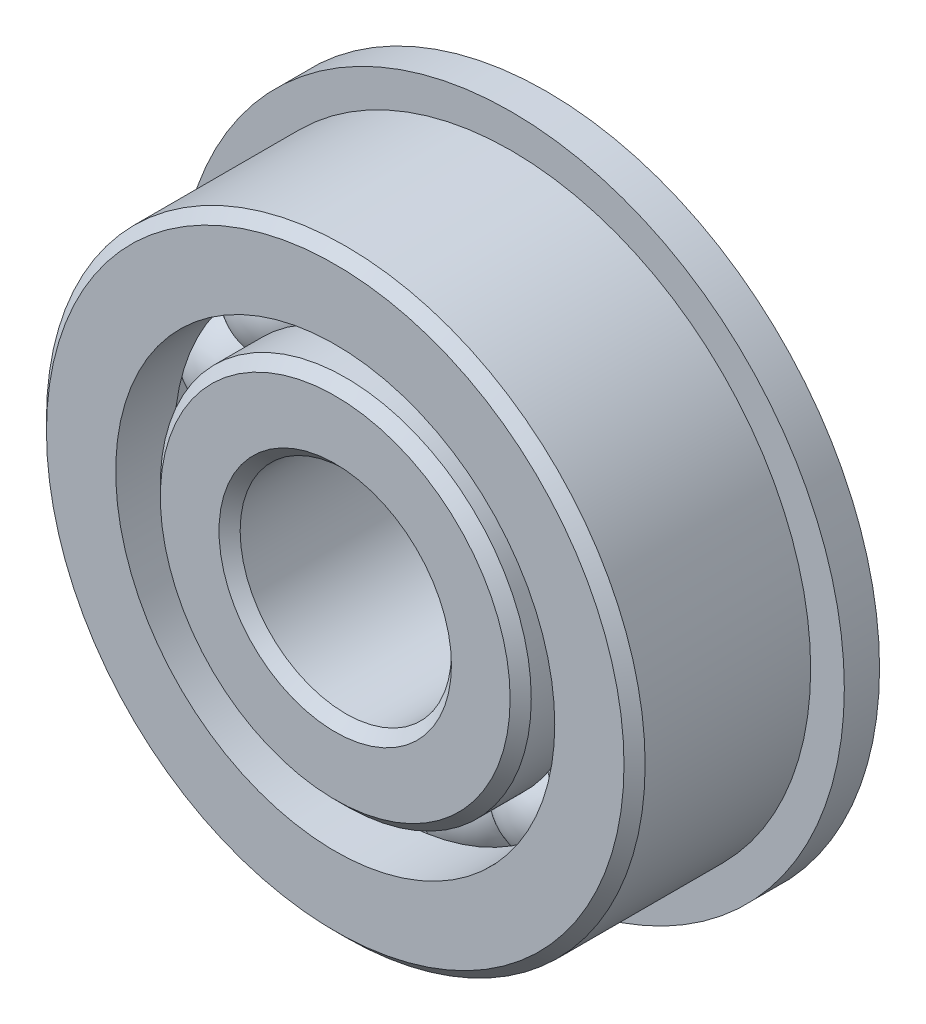
ISO-10303-21;
HEADER;
FILE_DESCRIPTION(('STEP AP214'),'2;1');
FILE_NAME('part.step','',(''),(''),'','','');
FILE_SCHEMA(('AUTOMOTIVE_DESIGN { 1 0 10303 214 1 1 1 1 }'));
ENDSEC;
DATA;
#1=APPLICATION_CONTEXT('core data for automotive mechanical design processes');
#2=APPLICATION_PROTOCOL_DEFINITION('international standard','automotive_design',2000,#1);
#3=PRODUCT_CONTEXT('',#1,'mechanical');
#4=PRODUCT('Part','Part','',(#3));
#5=PRODUCT_RELATED_PRODUCT_CATEGORY('part','',(#4));
#6=PRODUCT_DEFINITION_FORMATION('','',#4);
#7=PRODUCT_DEFINITION_CONTEXT('part definition',#1,'design');
#8=PRODUCT_DEFINITION('design','',#6,#7);
#9=PRODUCT_DEFINITION_SHAPE('','',#8);
#10=(LENGTH_UNIT() NAMED_UNIT(*) SI_UNIT(.MILLI.,.METRE.));
#11=(NAMED_UNIT(*) PLANE_ANGLE_UNIT() SI_UNIT($,.RADIAN.));
#12=(NAMED_UNIT(*) SI_UNIT($,.STERADIAN.) SOLID_ANGLE_UNIT());
#13=UNCERTAINTY_MEASURE_WITH_UNIT(LENGTH_MEASURE(1.E-05),#10,'distance_accuracy_value','');
#14=(GEOMETRIC_REPRESENTATION_CONTEXT(3) GLOBAL_UNCERTAINTY_ASSIGNED_CONTEXT((#13)) GLOBAL_UNIT_ASSIGNED_CONTEXT((#10,
#11,#12)) REPRESENTATION_CONTEXT('',''));
#15=CARTESIAN_POINT('',(0.,0.,0.));
#16=DIRECTION('',(0.,0.,1.));
#17=DIRECTION('',(1.,0.,0.));
#18=AXIS2_PLACEMENT_3D('',#15,#16,#17);
#19=CARTESIAN_POINT('',(-3.71274292007619,8.33895713054391,0.));
#20=DIRECTION('',(0.,0.,1.));
#21=DIRECTION('',(-0.406736643075789,0.913545457642606,0.));
#22=AXIS2_PLACEMENT_3D('',#19,#20,#21);
#23=SPHERICAL_SURFACE('',#22,2.25154625658889);
#24=CARTESIAN_POINT('',(-3.71274292007619,8.33895713054391,2.25154625658889));
#25=VERTEX_POINT('',#24);
#26=VERTEX_LOOP('',#25);
#27=FACE_BOUND('',#26,.T.);
#28=ADVANCED_FACE('F43',(#27),#23,.T.);
#29=CLOSED_SHELL('',(#28));
#30=MANIFOLD_SOLID_BREP('B2',#29);
#31=CARTESIAN_POINT('',(-6.78351886006077,6.10790781616953,0.));
#32=DIRECTION('',(0.,0.,1.));
#33=DIRECTION('',(-0.743144825477386,0.669130606358867,0.));
#34=AXIS2_PLACEMENT_3D('',#31,#32,#33);
#35=SPHERICAL_SURFACE('',#34,2.25154625658889);
#36=CARTESIAN_POINT('',(-6.78351886006077,6.10790781616953,2.25154625658889));
#37=VERTEX_POINT('',#36);
#38=VERTEX_LOOP('',#37);
#39=FACE_BOUND('',#38,.T.);
#40=ADVANCED_FACE('F67',(#39),#35,.T.);
#41=CLOSED_SHELL('',(#40));
#42=MANIFOLD_SOLID_BREP('B6',#41);
#43=CARTESIAN_POINT('',(-8.68136276280667,2.82074575177891,0.));
#44=DIRECTION('',(0.,0.,1.));
#45=DIRECTION('',(-0.95105651629515,0.309016994374957,0.));
#46=AXIS2_PLACEMENT_3D('',#43,#44,#45);
#47=SPHERICAL_SURFACE('',#46,2.25154625658889);
#48=CARTESIAN_POINT('',(-8.68136276280667,2.82074575177891,2.25154625658889));
#49=VERTEX_POINT('',#48);
#50=VERTEX_LOOP('',#49);
#51=FACE_BOUND('',#50,.T.);
#52=ADVANCED_FACE('F88',(#51),#47,.T.);
#53=CLOSED_SHELL('',(#52));
#54=MANIFOLD_SOLID_BREP('B39',#53);
#55=CARTESIAN_POINT('',(-9.07812017615853,-0.95414887876496,0.));
#56=DIRECTION('',(0.,0.,1.));
#57=DIRECTION('',(-0.994521895368274,-0.104528463267644,0.));
#58=AXIS2_PLACEMENT_3D('',#55,#56,#57);
#59=SPHERICAL_SURFACE('',#58,2.25154625658889);
#60=CARTESIAN_POINT('',(-9.07812017615853,-0.95414887876496,2.25154625658889));
#61=VERTEX_POINT('',#60);
#62=VERTEX_LOOP('',#61);
#63=FACE_BOUND('',#62,.T.);
#64=ADVANCED_FACE('F109',(#63),#59,.T.);
#65=CLOSED_SHELL('',(#64));
#66=MANIFOLD_SOLID_BREP('B63',#65);
#67=CARTESIAN_POINT('',(-7.90518813891987,-4.56406249999993,0.));
#68=DIRECTION('',(0.,0.,1.));
#69=DIRECTION('',(-0.866025403784443,-0.499999999999992,0.));
#70=AXIS2_PLACEMENT_3D('',#67,#68,#69);
#71=SPHERICAL_SURFACE('',#70,2.25154625658889);
#72=CARTESIAN_POINT('',(-7.90518813891987,-4.56406249999993,2.25154625658889));
#73=VERTEX_POINT('',#72);
#74=VERTEX_LOOP('',#73);
#75=FACE_BOUND('',#74,.T.);
#76=ADVANCED_FACE('F130',(#75),#71,.T.);
#77=CLOSED_SHELL('',(#76));
#78=MANIFOLD_SOLID_BREP('B84',#77);
#79=CARTESIAN_POINT('',(-5.36537725608229,-7.38480825177877,0.));
#80=DIRECTION('',(0.,0.,1.));
#81=DIRECTION('',(-0.58778525229248,-0.809016994374943,0.));
#82=AXIS2_PLACEMENT_3D('',#79,#80,#81);
#83=SPHERICAL_SURFACE('',#82,2.25154625658889);
#84=CARTESIAN_POINT('',(-5.36537725608229,-7.38480825177877,2.25154625658889));
#85=VERTEX_POINT('',#84);
#86=VERTEX_LOOP('',#85);
#87=FACE_BOUND('',#86,.T.);
#88=ADVANCED_FACE('F151',(#87),#83,.T.);
#89=CLOSED_SHELL('',(#88));
#90=MANIFOLD_SOLID_BREP('B105',#89);
#91=CARTESIAN_POINT('',(-1.89784390274592,-8.92865356794825,0.));
#92=DIRECTION('',(0.,0.,1.));
#93=DIRECTION('',(-0.207911690817766,-0.978147600733804,0.));
#94=AXIS2_PLACEMENT_3D('',#91,#92,#93);
#95=SPHERICAL_SURFACE('',#94,2.25154625658889);
#96=CARTESIAN_POINT('',(-1.89784390274592,-8.92865356794825,2.25154625658889));
#97=VERTEX_POINT('',#96);
#98=VERTEX_LOOP('',#97);
#99=FACE_BOUND('',#98,.T.);
#100=ADVANCED_FACE('F172',(#99),#95,.T.);
#101=CLOSED_SHELL('',(#100));
#102=MANIFOLD_SOLID_BREP('B126',#101);
#103=CARTESIAN_POINT('',(1.8978439027458,-8.92865356794828,0.));
#104=DIRECTION('',(0.,0.,1.));
#105=DIRECTION('',(0.207911690817753,-0.978147600733807,0.));
#106=AXIS2_PLACEMENT_3D('',#103,#104,#105);
#107=SPHERICAL_SURFACE('',#106,2.25154625658889);
#108=CARTESIAN_POINT('',(1.8978439027458,-8.92865356794828,2.25154625658889));
#109=VERTEX_POINT('',#108);
#110=VERTEX_LOOP('',#109);
#111=FACE_BOUND('',#110,.T.);
#112=ADVANCED_FACE('F193',(#111),#107,.T.);
#113=CLOSED_SHELL('',(#112));
#114=MANIFOLD_SOLID_BREP('B147',#113);
#115=CARTESIAN_POINT('',(5.36537725608219,-7.38480825177884,0.));
#116=DIRECTION('',(0.,0.,1.));
#117=DIRECTION('',(0.587785252292469,-0.80901699437495,0.));
#118=AXIS2_PLACEMENT_3D('',#115,#116,#117);
#119=SPHERICAL_SURFACE('',#118,2.25154625658889);
#120=CARTESIAN_POINT('',(5.36537725608219,-7.38480825177884,2.25154625658889));
#121=VERTEX_POINT('',#120);
#122=VERTEX_LOOP('',#121);
#123=FACE_BOUND('',#122,.T.);
#124=ADVANCED_FACE('F214',(#123),#119,.T.);
#125=CLOSED_SHELL('',(#124));
#126=MANIFOLD_SOLID_BREP('B168',#125);
#127=CARTESIAN_POINT('',(7.90518813891981,-4.56406250000004,0.));
#128=DIRECTION('',(0.,0.,1.));
#129=DIRECTION('',(0.866025403784436,-0.500000000000004,0.));
#130=AXIS2_PLACEMENT_3D('',#127,#128,#129);
#131=SPHERICAL_SURFACE('',#130,2.25154625658889);
#132=CARTESIAN_POINT('',(7.90518813891981,-4.56406250000004,2.25154625658889));
#133=VERTEX_POINT('',#132);
#134=VERTEX_LOOP('',#133);
#135=FACE_BOUND('',#134,.T.);
#136=ADVANCED_FACE('F235',(#135),#131,.T.);
#137=CLOSED_SHELL('',(#136));
#138=MANIFOLD_SOLID_BREP('B189',#137);
#139=CARTESIAN_POINT('',(9.07812017615852,-0.954148878765082,0.));
#140=DIRECTION('',(0.,0.,1.));
#141=DIRECTION('',(0.994521895368273,-0.104528463267657,0.));
#142=AXIS2_PLACEMENT_3D('',#139,#140,#141);
#143=SPHERICAL_SURFACE('',#142,2.25154625658889);
#144=CARTESIAN_POINT('',(9.07812017615852,-0.954148878765082,2.25154625658889));
#145=VERTEX_POINT('',#144);
#146=VERTEX_LOOP('',#145);
#147=FACE_BOUND('',#146,.T.);
#148=ADVANCED_FACE('F256',(#147),#143,.T.);
#149=CLOSED_SHELL('',(#148));
#150=MANIFOLD_SOLID_BREP('B210',#149);
#151=CARTESIAN_POINT('',(8.6813627628067,2.82074575177879,0.));
#152=DIRECTION('',(0.,0.,1.));
#153=DIRECTION('',(0.951056516295154,0.309016994374945,0.));
#154=AXIS2_PLACEMENT_3D('',#151,#152,#153);
#155=SPHERICAL_SURFACE('',#154,2.25154625658889);
#156=CARTESIAN_POINT('',(8.6813627628067,2.82074575177879,2.25154625658889));
#157=VERTEX_POINT('',#156);
#158=VERTEX_LOOP('',#157);
#159=FACE_BOUND('',#158,.T.);
#160=ADVANCED_FACE('F278',(#159),#155,.T.);
#161=CLOSED_SHELL('',(#160));
#162=MANIFOLD_SOLID_BREP('B231',#161);
#163=CARTESIAN_POINT('',(6.78351886006085,6.10790781616944,0.));
#164=DIRECTION('',(0.,0.,1.));
#165=DIRECTION('',(0.743144825477395,0.669130606358857,0.));
#166=AXIS2_PLACEMENT_3D('',#163,#164,#165);
#167=SPHERICAL_SURFACE('',#166,2.25154625658889);
#168=CARTESIAN_POINT('',(6.78351886006085,6.10790781616944,2.25154625658889));
#169=VERTEX_POINT('',#168);
#170=VERTEX_LOOP('',#169);
#171=FACE_BOUND('',#170,.T.);
#172=ADVANCED_FACE('F302',(#171),#167,.T.);
#173=CLOSED_SHELL('',(#172));
#174=MANIFOLD_SOLID_BREP('B252',#173);
#175=CARTESIAN_POINT('',(3.7127429200763,8.33895713054386,0.));
#176=DIRECTION('',(0.,0.,1.));
#177=DIRECTION('',(0.406736643075801,0.913545457642601,0.));
#178=AXIS2_PLACEMENT_3D('',#175,#176,#177);
#179=SPHERICAL_SURFACE('',#178,2.25154625658889);
#180=CARTESIAN_POINT('',(3.7127429200763,8.33895713054386,2.25154625658889));
#181=VERTEX_POINT('',#180);
#182=VERTEX_LOOP('',#181);
#183=FACE_BOUND('',#182,.T.);
#184=ADVANCED_FACE('F323',(#183),#179,.T.);
#185=CLOSED_SHELL('',(#184));
#186=MANIFOLD_SOLID_BREP('B274',#185);
#187=CARTESIAN_POINT('',(0.,9.128125,0.));
#188=DIRECTION('',(0.,0.,1.));
#189=DIRECTION('',(0.,1.,0.));
#190=AXIS2_PLACEMENT_3D('',#187,#188,#189);
#191=SPHERICAL_SURFACE('',#190,2.25154625658889);
#192=CARTESIAN_POINT('',(0.,9.128125,2.25154625658889));
#193=VERTEX_POINT('',#192);
#194=VERTEX_LOOP('',#193);
#195=FACE_BOUND('',#194,.T.);
#196=ADVANCED_FACE('F347',(#195),#191,.T.);
#197=CLOSED_SHELL('',(#196));
#198=MANIFOLD_SOLID_BREP('B298',#197);
#199=CARTESIAN_POINT('',(0.,0.,4.28625));
#200=DIRECTION('',(0.,0.,-1.));
#201=DIRECTION('',(-1.,0.,0.));
#202=AXIS2_PLACEMENT_3D('',#199,#200,#201);
#203=CONICAL_SURFACE('',#202,8.36054258241758,0.785398163397447);
#204=CARTESIAN_POINT('',(0.,0.,4.7625));
#205=DIRECTION('',(0.,0.,1.));
#206=DIRECTION('',(1.,0.,0.));
#207=AXIS2_PLACEMENT_3D('',#204,#205,#206);
#208=CIRCLE('',#207,7.88429258241758);
#209=CARTESIAN_POINT('',(7.88429258241758,0.,4.7625));
#210=VERTEX_POINT('',#209);
#211=EDGE_CURVE('E405',#210,#210,#208,.T.);
#212=ORIENTED_EDGE('',*,*,#211,.F.);
#213=EDGE_LOOP('',(#212));
#214=FACE_BOUND('',#213,.T.);
#215=CARTESIAN_POINT('',(0.,0.,4.28625));
#216=DIRECTION('',(0.,0.,1.));
#217=DIRECTION('',(1.,0.,0.));
#218=AXIS2_PLACEMENT_3D('',#215,#216,#217);
#219=CIRCLE('',#218,8.36054258241758);
#220=CARTESIAN_POINT('',(8.36054258241758,0.,4.28625));
#221=VERTEX_POINT('',#220);
#222=EDGE_CURVE('E346',#221,#221,#219,.T.);
#223=ORIENTED_EDGE('',*,*,#222,.T.);
#224=EDGE_LOOP('',(#223));
#225=FACE_BOUND('',#224,.T.);
#226=ADVANCED_FACE('F371',(#214,#225),#203,.T.);
#227=CARTESIAN_POINT('',(0.,0.,4.7625));
#228=DIRECTION('',(0.,0.,1.));
#229=DIRECTION('',(1.,0.,0.));
#230=AXIS2_PLACEMENT_3D('',#227,#228,#229);
#231=CYLINDRICAL_SURFACE('',#230,8.36054258241758);
#232=ORIENTED_EDGE('',*,*,#222,.F.);
#233=EDGE_LOOP('',(#232));
#234=FACE_BOUND('',#233,.T.);
#235=CARTESIAN_POINT('',(0.,0.,2.11666666666666));
#236=DIRECTION('',(0.,0.,1.));
#237=DIRECTION('',(1.,0.,0.));
#238=AXIS2_PLACEMENT_3D('',#235,#236,#237);
#239=CIRCLE('',#238,8.36054258241759);
#240=CARTESIAN_POINT('',(8.36054258241759,0.,2.11666666666666));
#241=VERTEX_POINT('',#240);
#242=EDGE_CURVE('E377',#241,#241,#239,.T.);
#243=ORIENTED_EDGE('',*,*,#242,.T.);
#244=EDGE_LOOP('',(#243));
#245=FACE_BOUND('',#244,.T.);
#246=ADVANCED_FACE('F412',(#234,#245),#231,.T.);
#247=CARTESIAN_POINT('',(0.,0.,0.));
#248=DIRECTION('',(0.,0.,1.));
#249=DIRECTION('',(1.,0.,0.));
#250=AXIS2_PLACEMENT_3D('',#247,#248,#249);
#251=TOROIDAL_SURFACE('',#250,9.12812499999999,2.25154625658889);
#252=ORIENTED_EDGE('',*,*,#242,.F.);
#253=EDGE_LOOP('',(#252));
#254=FACE_BOUND('',#253,.T.);
#255=CARTESIAN_POINT('',(0.,0.,-2.11666666666667));
#256=DIRECTION('',(0.,0.,1.));
#257=DIRECTION('',(1.,0.,0.));
#258=AXIS2_PLACEMENT_3D('',#255,#256,#257);
#259=CIRCLE('',#258,8.36054258241758);
#260=CARTESIAN_POINT('',(8.36054258241758,0.,-2.11666666666667));
#261=VERTEX_POINT('',#260);
#262=EDGE_CURVE('E381',#261,#261,#259,.T.);
#263=ORIENTED_EDGE('',*,*,#262,.T.);
#264=EDGE_LOOP('',(#263));
#265=FACE_BOUND('',#264,.T.);
#266=ADVANCED_FACE('F416',(#254,#265),#251,.F.);
#267=CARTESIAN_POINT('',(0.,0.,4.7625));
#268=DIRECTION('',(0.,0.,1.));
#269=DIRECTION('',(1.,0.,0.));
#270=AXIS2_PLACEMENT_3D('',#267,#268,#269);
#271=CYLINDRICAL_SURFACE('',#270,8.36054258241758);
#272=ORIENTED_EDGE('',*,*,#262,.F.);
#273=EDGE_LOOP('',(#272));
#274=FACE_BOUND('',#273,.T.);
#275=CARTESIAN_POINT('',(0.,0.,-5.87375));
#276=DIRECTION('',(0.,0.,1.));
#277=DIRECTION('',(1.,0.,0.));
#278=AXIS2_PLACEMENT_3D('',#275,#276,#277);
#279=CIRCLE('',#278,8.36054258241758);
#280=CARTESIAN_POINT('',(8.36054258241758,0.,-5.87375));
#281=VERTEX_POINT('',#280);
#282=EDGE_CURVE('E385',#281,#281,#279,.T.);
#283=ORIENTED_EDGE('',*,*,#282,.T.);
#284=EDGE_LOOP('',(#283));
#285=FACE_BOUND('',#284,.T.);
#286=ADVANCED_FACE('F421',(#274,#285),#271,.T.);
#287=CARTESIAN_POINT('',(0.,0.,-6.35));
#288=DIRECTION('',(0.,0.,1.));
#289=DIRECTION('',(1.,0.,0.));
#290=AXIS2_PLACEMENT_3D('',#287,#288,#289);
#291=CONICAL_SURFACE('',#290,7.88429258241758,0.785398163397447);
#292=ORIENTED_EDGE('',*,*,#282,.F.);
#293=EDGE_LOOP('',(#292));
#294=FACE_BOUND('',#293,.T.);
#295=CARTESIAN_POINT('',(0.,0.,-6.35));
#296=DIRECTION('',(0.,0.,1.));
#297=DIRECTION('',(1.,0.,0.));
#298=AXIS2_PLACEMENT_3D('',#295,#296,#297);
#299=CIRCLE('',#298,7.88429258241758);
#300=CARTESIAN_POINT('',(7.88429258241758,0.,-6.35));
#301=VERTEX_POINT('',#300);
#302=EDGE_CURVE('E390',#301,#301,#299,.T.);
#303=ORIENTED_EDGE('',*,*,#302,.T.);
#304=EDGE_LOOP('',(#303));
#305=FACE_BOUND('',#304,.T.);
#306=ADVANCED_FACE('F427',(#294,#305),#291,.T.);
#307=CARTESIAN_POINT('',(0.,7.88429258241758,-6.35));
#308=DIRECTION('',(0.,0.,1.));
#309=DIRECTION('',(1.,0.,0.));
#310=AXIS2_PLACEMENT_3D('',#307,#308,#309);
#311=PLANE('',#310);
#312=ORIENTED_EDGE('',*,*,#302,.F.);
#313=EDGE_LOOP('',(#312));
#314=FACE_BOUND('',#313,.T.);
#315=CARTESIAN_POINT('',(0.,0.,-6.35));
#316=DIRECTION('',(0.,0.,1.));
#317=DIRECTION('',(1.,0.,0.));
#318=AXIS2_PLACEMENT_3D('',#315,#316,#317);
#319=CIRCLE('',#318,5.23875);
#320=CARTESIAN_POINT('',(5.23875,0.,-6.35));
#321=VERTEX_POINT('',#320);
#322=EDGE_CURVE('E393',#321,#321,#319,.T.);
#323=ORIENTED_EDGE('',*,*,#322,.T.);
#324=EDGE_LOOP('',(#323));
#325=FACE_BOUND('',#324,.T.);
#326=ADVANCED_FACE('F431',(#314,#325),#311,.F.);
#327=CARTESIAN_POINT('',(0.,0.,-5.87375));
#328=DIRECTION('',(0.,0.,-1.));
#329=DIRECTION('',(-1.,0.,0.));
#330=AXIS2_PLACEMENT_3D('',#327,#328,#329);
#331=CONICAL_SURFACE('',#330,4.7625,0.785398163397448);
#332=ORIENTED_EDGE('',*,*,#322,.F.);
#333=EDGE_LOOP('',(#332));
#334=FACE_BOUND('',#333,.T.);
#335=CARTESIAN_POINT('',(0.,0.,-5.87375));
#336=DIRECTION('',(0.,0.,1.));
#337=DIRECTION('',(1.,0.,0.));
#338=AXIS2_PLACEMENT_3D('',#335,#336,#337);
#339=CIRCLE('',#338,4.7625);
#340=CARTESIAN_POINT('',(4.7625,0.,-5.87375));
#341=VERTEX_POINT('',#340);
#342=EDGE_CURVE('E396',#341,#341,#339,.T.);
#343=ORIENTED_EDGE('',*,*,#342,.T.);
#344=EDGE_LOOP('',(#343));
#345=FACE_BOUND('',#344,.T.);
#346=ADVANCED_FACE('F435',(#334,#345),#331,.F.);
#347=CARTESIAN_POINT('',(0.,0.,4.7625));
#348=DIRECTION('',(0.,0.,1.));
#349=DIRECTION('',(1.,0.,0.));
#350=AXIS2_PLACEMENT_3D('',#347,#348,#349);
#351=CYLINDRICAL_SURFACE('',#350,4.7625);
#352=ORIENTED_EDGE('',*,*,#342,.F.);
#353=EDGE_LOOP('',(#352));
#354=FACE_BOUND('',#353,.T.);
#355=CARTESIAN_POINT('',(0.,0.,4.28625));
#356=DIRECTION('',(0.,0.,1.));
#357=DIRECTION('',(1.,0.,0.));
#358=AXIS2_PLACEMENT_3D('',#355,#356,#357);
#359=CIRCLE('',#358,4.7625);
#360=CARTESIAN_POINT('',(4.7625,0.,4.28625));
#361=VERTEX_POINT('',#360);
#362=EDGE_CURVE('E399',#361,#361,#359,.T.);
#363=ORIENTED_EDGE('',*,*,#362,.T.);
#364=EDGE_LOOP('',(#363));
#365=FACE_BOUND('',#364,.T.);
#366=ADVANCED_FACE('F439',(#354,#365),#351,.F.);
#367=CARTESIAN_POINT('',(0.,0.,4.7625));
#368=DIRECTION('',(0.,0.,1.));
#369=DIRECTION('',(1.,0.,0.));
#370=AXIS2_PLACEMENT_3D('',#367,#368,#369);
#371=CONICAL_SURFACE('',#370,5.23875,0.785398163397451);
#372=ORIENTED_EDGE('',*,*,#362,.F.);
#373=EDGE_LOOP('',(#372));
#374=FACE_BOUND('',#373,.T.);
#375=CARTESIAN_POINT('',(0.,0.,4.7625));
#376=DIRECTION('',(0.,0.,1.));
#377=DIRECTION('',(1.,0.,0.));
#378=AXIS2_PLACEMENT_3D('',#375,#376,#377);
#379=CIRCLE('',#378,5.23875);
#380=CARTESIAN_POINT('',(5.23875,0.,4.7625));
#381=VERTEX_POINT('',#380);
#382=EDGE_CURVE('E402',#381,#381,#379,.T.);
#383=ORIENTED_EDGE('',*,*,#382,.T.);
#384=EDGE_LOOP('',(#383));
#385=FACE_BOUND('',#384,.T.);
#386=ADVANCED_FACE('F443',(#374,#385),#371,.F.);
#387=CARTESIAN_POINT('',(0.,5.23875,4.7625));
#388=DIRECTION('',(0.,0.,-1.));
#389=DIRECTION('',(-1.,0.,0.));
#390=AXIS2_PLACEMENT_3D('',#387,#388,#389);
#391=PLANE('',#390);
#392=ORIENTED_EDGE('',*,*,#382,.F.);
#393=EDGE_LOOP('',(#392));
#394=FACE_BOUND('',#393,.T.);
#395=ORIENTED_EDGE('',*,*,#211,.T.);
#396=EDGE_LOOP('',(#395));
#397=FACE_BOUND('',#396,.T.);
#398=ADVANCED_FACE('F409',(#394,#397),#391,.F.);
#399=CLOSED_SHELL('',(#226,#246,#266,#286,#306,#326,#346,#366,#386,#398));
#400=MANIFOLD_SOLID_BREP('B319',#399);
#401=CARTESIAN_POINT('',(0.,0.,4.28625));
#402=DIRECTION('',(0.,0.,-1.));
#403=DIRECTION('',(-1.,0.,0.));
#404=AXIS2_PLACEMENT_3D('',#401,#402,#403);
#405=CONICAL_SURFACE('',#404,13.49375,0.785398163397447);
#406=CARTESIAN_POINT('',(0.,0.,4.7625));
#407=DIRECTION('',(0.,0.,1.));
#408=DIRECTION('',(1.,0.,0.));
#409=AXIS2_PLACEMENT_3D('',#406,#407,#408);
#410=CIRCLE('',#409,13.0175);
#411=CARTESIAN_POINT('',(13.0175,0.,4.7625));
#412=VERTEX_POINT('',#411);
#413=EDGE_CURVE('E548',#412,#412,#410,.T.);
#414=ORIENTED_EDGE('',*,*,#413,.F.);
#415=EDGE_LOOP('',(#414));
#416=FACE_BOUND('',#415,.T.);
#417=CARTESIAN_POINT('',(0.,0.,4.28625));
#418=DIRECTION('',(0.,0.,1.));
#419=DIRECTION('',(1.,0.,0.));
#420=AXIS2_PLACEMENT_3D('',#417,#418,#419);
#421=CIRCLE('',#420,13.49375);
#422=CARTESIAN_POINT('',(13.49375,0.,4.28625));
#423=VERTEX_POINT('',#422);
#424=EDGE_CURVE('E370',#423,#423,#421,.T.);
#425=ORIENTED_EDGE('',*,*,#424,.T.);
#426=EDGE_LOOP('',(#425));
#427=FACE_BOUND('',#426,.T.);
#428=ADVANCED_FACE('F526',(#416,#427),#405,.T.);
#429=CARTESIAN_POINT('',(0.,0.,4.7625));
#430=DIRECTION('',(0.,0.,1.));
#431=DIRECTION('',(1.,0.,0.));
#432=AXIS2_PLACEMENT_3D('',#429,#430,#431);
#433=CYLINDRICAL_SURFACE('',#432,13.49375);
#434=CARTESIAN_POINT('',(0.,0.,-3.175));
#435=DIRECTION('',(0.,0.,1.));
#436=DIRECTION('',(1.,0.,0.));
#437=AXIS2_PLACEMENT_3D('',#434,#435,#436);
#438=CIRCLE('',#437,13.49375);
#439=CARTESIAN_POINT('',(13.49375,0.,-3.175));
#440=VERTEX_POINT('',#439);
#441=EDGE_CURVE('E551',#440,#440,#438,.T.);
#442=ORIENTED_EDGE('',*,*,#441,.T.);
#443=EDGE_LOOP('',(#442));
#444=FACE_BOUND('',#443,.T.);
#445=ORIENTED_EDGE('',*,*,#424,.F.);
#446=EDGE_LOOP('',(#445));
#447=FACE_BOUND('',#446,.T.);
#448=ADVANCED_FACE('F571',(#444,#447),#433,.T.);
#449=CARTESIAN_POINT('',(0.,13.0175,-4.7625));
#450=DIRECTION('',(0.,0.,1.));
#451=DIRECTION('',(1.,0.,0.));
#452=AXIS2_PLACEMENT_3D('',#449,#450,#451);
#453=PLANE('',#452);
#454=CARTESIAN_POINT('',(0.,0.,-4.7625));
#455=DIRECTION('',(0.,0.,1.));
#456=DIRECTION('',(1.,0.,0.));
#457=AXIS2_PLACEMENT_3D('',#454,#455,#456);
#458=CIRCLE('',#457,9.89570741758242);
#459=CARTESIAN_POINT('',(9.89570741758242,0.,-4.7625));
#460=VERTEX_POINT('',#459);
#461=EDGE_CURVE('E532',#460,#460,#458,.T.);
#462=ORIENTED_EDGE('',*,*,#461,.T.);
#463=EDGE_LOOP('',(#462));
#464=FACE_BOUND('',#463,.T.);
#465=CARTESIAN_POINT('',(0.,0.,-4.7625));
#466=DIRECTION('',(0.,0.,-1.));
#467=DIRECTION('',(-1.,0.,0.));
#468=AXIS2_PLACEMENT_3D('',#465,#466,#467);
#469=CIRCLE('',#468,15.0114);
#470=CARTESIAN_POINT('',(-15.0114,0.,-4.7625));
#471=VERTEX_POINT('',#470);
#472=EDGE_CURVE('E554',#471,#471,#469,.T.);
#473=ORIENTED_EDGE('',*,*,#472,.T.);
#474=EDGE_LOOP('',(#473));
#475=FACE_BOUND('',#474,.T.);
#476=ADVANCED_FACE('F574',(#464,#475),#453,.F.);
#477=CARTESIAN_POINT('',(0.,0.,4.7625));
#478=DIRECTION('',(0.,0.,1.));
#479=DIRECTION('',(1.,0.,0.));
#480=AXIS2_PLACEMENT_3D('',#477,#478,#479);
#481=CYLINDRICAL_SURFACE('',#480,9.89570741758242);
#482=CARTESIAN_POINT('',(0.,0.,-2.11666666666667));
#483=DIRECTION('',(0.,0.,1.));
#484=DIRECTION('',(1.,0.,0.));
#485=AXIS2_PLACEMENT_3D('',#482,#483,#484);
#486=CIRCLE('',#485,9.89570741758242);
#487=CARTESIAN_POINT('',(9.89570741758242,0.,-2.11666666666667));
#488=VERTEX_POINT('',#487);
#489=EDGE_CURVE('E536',#488,#488,#486,.T.);
#490=ORIENTED_EDGE('',*,*,#489,.T.);
#491=EDGE_LOOP('',(#490));
#492=FACE_BOUND('',#491,.T.);
#493=ORIENTED_EDGE('',*,*,#461,.F.);
#494=EDGE_LOOP('',(#493));
#495=FACE_BOUND('',#494,.T.);
#496=ADVANCED_FACE('F579',(#492,#495),#481,.F.);
#497=CARTESIAN_POINT('',(0.,0.,0.));
#498=DIRECTION('',(0.,0.,1.));
#499=DIRECTION('',(1.,0.,0.));
#500=AXIS2_PLACEMENT_3D('',#497,#498,#499);
#501=TOROIDAL_SURFACE('',#500,9.128125,2.25154625658889);
#502=ORIENTED_EDGE('',*,*,#489,.F.);
#503=EDGE_LOOP('',(#502));
#504=FACE_BOUND('',#503,.T.);
#505=CARTESIAN_POINT('',(0.,0.,2.11666666666667));
#506=DIRECTION('',(0.,0.,1.));
#507=DIRECTION('',(1.,0.,0.));
#508=AXIS2_PLACEMENT_3D('',#505,#506,#507);
#509=CIRCLE('',#508,9.89570741758242);
#510=CARTESIAN_POINT('',(9.89570741758242,0.,2.11666666666667));
#511=VERTEX_POINT('',#510);
#512=EDGE_CURVE('E540',#511,#511,#509,.T.);
#513=ORIENTED_EDGE('',*,*,#512,.T.);
#514=EDGE_LOOP('',(#513));
#515=FACE_BOUND('',#514,.T.);
#516=ADVANCED_FACE('F585',(#504,#515),#501,.F.);
#517=CARTESIAN_POINT('',(0.,0.,4.7625));
#518=DIRECTION('',(0.,0.,1.));
#519=DIRECTION('',(1.,0.,0.));
#520=AXIS2_PLACEMENT_3D('',#517,#518,#519);
#521=CYLINDRICAL_SURFACE('',#520,9.89570741758242);
#522=ORIENTED_EDGE('',*,*,#512,.F.);
#523=EDGE_LOOP('',(#522));
#524=FACE_BOUND('',#523,.T.);
#525=CARTESIAN_POINT('',(0.,0.,4.7625));
#526=DIRECTION('',(0.,0.,1.));
#527=DIRECTION('',(1.,0.,0.));
#528=AXIS2_PLACEMENT_3D('',#525,#526,#527);
#529=CIRCLE('',#528,9.89570741758242);
#530=CARTESIAN_POINT('',(9.89570741758242,0.,4.7625));
#531=VERTEX_POINT('',#530);
#532=EDGE_CURVE('E545',#531,#531,#529,.T.);
#533=ORIENTED_EDGE('',*,*,#532,.T.);
#534=EDGE_LOOP('',(#533));
#535=FACE_BOUND('',#534,.T.);
#536=ADVANCED_FACE('F589',(#524,#535),#521,.F.);
#537=CARTESIAN_POINT('',(0.,13.0175,4.7625));
#538=DIRECTION('',(0.,0.,-1.));
#539=DIRECTION('',(-1.,0.,0.));
#540=AXIS2_PLACEMENT_3D('',#537,#538,#539);
#541=PLANE('',#540);
#542=ORIENTED_EDGE('',*,*,#532,.F.);
#543=EDGE_LOOP('',(#542));
#544=FACE_BOUND('',#543,.T.);
#545=ORIENTED_EDGE('',*,*,#413,.T.);
#546=EDGE_LOOP('',(#545));
#547=FACE_BOUND('',#546,.T.);
#548=ADVANCED_FACE('F567',(#544,#547),#541,.F.);
#549=CARTESIAN_POINT('',(0.,9.89570741758242,-3.175));
#550=DIRECTION('',(0.,0.,1.));
#551=DIRECTION('',(1.,0.,0.));
#552=AXIS2_PLACEMENT_3D('',#549,#550,#551);
#553=PLANE('',#552);
#554=CARTESIAN_POINT('',(0.,0.,-3.175));
#555=DIRECTION('',(0.,0.,-1.));
#556=DIRECTION('',(-1.,0.,0.));
#557=AXIS2_PLACEMENT_3D('',#554,#555,#556);
#558=CIRCLE('',#557,15.0114);
#559=CARTESIAN_POINT('',(-15.0114,0.,-3.175));
#560=VERTEX_POINT('',#559);
#561=EDGE_CURVE('E557',#560,#560,#558,.T.);
#562=ORIENTED_EDGE('',*,*,#561,.F.);
#563=EDGE_LOOP('',(#562));
#564=FACE_BOUND('',#563,.T.);
#565=ORIENTED_EDGE('',*,*,#441,.F.);
#566=EDGE_LOOP('',(#565));
#567=FACE_BOUND('',#566,.T.);
#568=ADVANCED_FACE('F564',(#564,#567),#553,.T.);
#569=CARTESIAN_POINT('',(0.,0.,-4.7625));
#570=DIRECTION('',(0.,0.,-1.));
#571=DIRECTION('',(-1.,0.,0.));
#572=AXIS2_PLACEMENT_3D('',#569,#570,#571);
#573=CYLINDRICAL_SURFACE('',#572,15.0114);
#574=ORIENTED_EDGE('',*,*,#561,.T.);
#575=EDGE_LOOP('',(#574));
#576=FACE_BOUND('',#575,.T.);
#577=ORIENTED_EDGE('',*,*,#472,.F.);
#578=EDGE_LOOP('',(#577));
#579=FACE_BOUND('',#578,.T.);
#580=ADVANCED_FACE('F561',(#576,#579),#573,.T.);
#581=CLOSED_SHELL('',(#428,#448,#476,#496,#516,#536,#548,#568,#580));
#582=MANIFOLD_SOLID_BREP('B341',#581);
#583=ADVANCED_BREP_SHAPE_REPRESENTATION('',(#18,#30,#42,#54,#66,#78,#90,#102,#114,#126,#138,
#150,#162,#174,#186,#198,#400,#582),#14);
#584=SHAPE_DEFINITION_REPRESENTATION(#9,#583);
ENDSEC;
END-ISO-10303-21;
